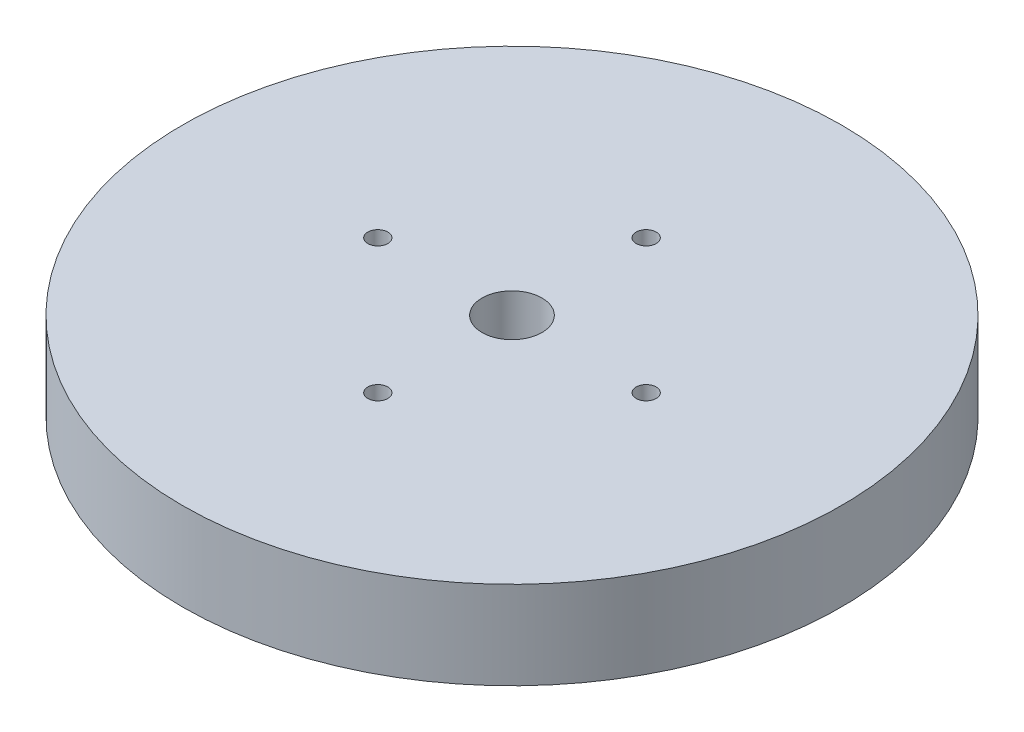
ISO-10303-21;
HEADER;
FILE_DESCRIPTION(('STEP AP214'),'2;1');
FILE_NAME('part.step','',(''),(''),'','','');
FILE_SCHEMA(('AUTOMOTIVE_DESIGN { 1 0 10303 214 1 1 1 1 }'));
ENDSEC;
DATA;
#1=APPLICATION_CONTEXT('core data for automotive mechanical design processes');
#2=APPLICATION_PROTOCOL_DEFINITION('international standard','automotive_design',2000,#1);
#3=PRODUCT_CONTEXT('',#1,'mechanical');
#4=PRODUCT('Part','Part','',(#3));
#5=PRODUCT_RELATED_PRODUCT_CATEGORY('part','',(#4));
#6=PRODUCT_DEFINITION_FORMATION('','',#4);
#7=PRODUCT_DEFINITION_CONTEXT('part definition',#1,'design');
#8=PRODUCT_DEFINITION('design','',#6,#7);
#9=PRODUCT_DEFINITION_SHAPE('','',#8);
#10=(LENGTH_UNIT() NAMED_UNIT(*) SI_UNIT(.MILLI.,.METRE.));
#11=(NAMED_UNIT(*) PLANE_ANGLE_UNIT() SI_UNIT($,.RADIAN.));
#12=(NAMED_UNIT(*) SI_UNIT($,.STERADIAN.) SOLID_ANGLE_UNIT());
#13=UNCERTAINTY_MEASURE_WITH_UNIT(LENGTH_MEASURE(1.E-05),#10,'distance_accuracy_value','');
#14=(GEOMETRIC_REPRESENTATION_CONTEXT(3) GLOBAL_UNCERTAINTY_ASSIGNED_CONTEXT((#13)) GLOBAL_UNIT_ASSIGNED_CONTEXT((#10,
#11,#12)) REPRESENTATION_CONTEXT('',''));
#15=CARTESIAN_POINT('',(0.,0.,0.));
#16=DIRECTION('',(0.,0.,1.));
#17=DIRECTION('',(1.,0.,0.));
#18=AXIS2_PLACEMENT_3D('',#15,#16,#17);
#19=CARTESIAN_POINT('',(0.,22.,0.));
#20=DIRECTION('',(0.,-1.,0.));
#21=DIRECTION('',(0.,0.,-1.));
#22=AXIS2_PLACEMENT_3D('',#19,#20,#21);
#23=CYLINDRICAL_SURFACE('',#22,82.5);
#24=CARTESIAN_POINT('',(0.,22.,0.));
#25=DIRECTION('',(0.,1.,0.));
#26=DIRECTION('',(0.,0.,1.));
#27=AXIS2_PLACEMENT_3D('',#24,#25,#26);
#28=CIRCLE('',#27,82.5);
#29=CARTESIAN_POINT('',(0.,22.,82.5));
#30=VERTEX_POINT('',#29);
#31=EDGE_CURVE('E10',#30,#30,#28,.T.);
#32=ORIENTED_EDGE('',*,*,#31,.F.);
#33=EDGE_LOOP('',(#32));
#34=FACE_BOUND('',#33,.T.);
#35=CARTESIAN_POINT('',(0.,0.,0.));
#36=DIRECTION('',(0.,1.,0.));
#37=DIRECTION('',(0.,0.,1.));
#38=AXIS2_PLACEMENT_3D('',#35,#36,#37);
#39=CIRCLE('',#38,82.5);
#40=CARTESIAN_POINT('',(0.,0.,82.5));
#41=VERTEX_POINT('',#40);
#42=EDGE_CURVE('E37',#41,#41,#39,.T.);
#43=ORIENTED_EDGE('',*,*,#42,.T.);
#44=EDGE_LOOP('',(#43));
#45=FACE_BOUND('',#44,.T.);
#46=ADVANCED_FACE('F40',(#34,#45),#23,.T.);
#47=CARTESIAN_POINT('',(0.,22.,0.));
#48=DIRECTION('',(0.,1.,0.));
#49=DIRECTION('',(0.,0.,1.));
#50=AXIS2_PLACEMENT_3D('',#47,#48,#49);
#51=PLANE('',#50);
#52=CARTESIAN_POINT('',(1.17267353394834E-13,22.,33.5867049009315));
#53=DIRECTION('',(0.,1.,0.));
#54=DIRECTION('',(1.,0.,0.));
#55=AXIS2_PLACEMENT_3D('',#52,#53,#54);
#56=CIRCLE('',#55,2.50603523285753);
#57=CARTESIAN_POINT('',(2.50603523285764,22.,33.5867049009315));
#58=VERTEX_POINT('',#57);
#59=EDGE_CURVE('E71',#58,#58,#56,.T.);
#60=ORIENTED_EDGE('',*,*,#59,.F.);
#61=EDGE_LOOP('',(#60));
#62=FACE_BOUND('',#61,.T.);
#63=CARTESIAN_POINT('',(33.5867049009315,22.,0.));
#64=DIRECTION('',(0.,1.,0.));
#65=DIRECTION('',(0.,0.,-1.));
#66=AXIS2_PLACEMENT_3D('',#63,#64,#65);
#67=CIRCLE('',#66,2.50603523285753);
#68=CARTESIAN_POINT('',(33.5867049009315,22.,-2.50603523285753));
#69=VERTEX_POINT('',#68);
#70=EDGE_CURVE('E70',#69,#69,#67,.T.);
#71=ORIENTED_EDGE('',*,*,#70,.F.);
#72=EDGE_LOOP('',(#71));
#73=FACE_BOUND('',#72,.T.);
#74=CARTESIAN_POINT('',(-3.51802060184501E-13,22.,-33.5867049009315));
#75=DIRECTION('',(0.,1.,0.));
#76=DIRECTION('',(-1.,0.,0.));
#77=AXIS2_PLACEMENT_3D('',#74,#75,#76);
#78=CIRCLE('',#77,2.50603523285753);
#79=CARTESIAN_POINT('',(-2.50603523285788,22.,-33.5867049009315));
#80=VERTEX_POINT('',#79);
#81=EDGE_CURVE('E61',#80,#80,#78,.T.);
#82=ORIENTED_EDGE('',*,*,#81,.F.);
#83=EDGE_LOOP('',(#82));
#84=FACE_BOUND('',#83,.T.);
#85=CARTESIAN_POINT('',(-33.5867049009315,22.,0.));
#86=DIRECTION('',(0.,1.,0.));
#87=DIRECTION('',(0.,0.,1.));
#88=AXIS2_PLACEMENT_3D('',#85,#86,#87);
#89=CIRCLE('',#88,2.50603523285753);
#90=CARTESIAN_POINT('',(-33.5867049009315,22.,2.50603523285753));
#91=VERTEX_POINT('',#90);
#92=EDGE_CURVE('E54',#91,#91,#89,.T.);
#93=ORIENTED_EDGE('',*,*,#92,.F.);
#94=EDGE_LOOP('',(#93));
#95=FACE_BOUND('',#94,.T.);
#96=CARTESIAN_POINT('',(0.,22.,0.));
#97=DIRECTION('',(0.,1.,0.));
#98=DIRECTION('',(0.,0.,1.));
#99=AXIS2_PLACEMENT_3D('',#96,#97,#98);
#100=CIRCLE('',#99,7.5);
#101=CARTESIAN_POINT('',(0.,22.,7.5));
#102=VERTEX_POINT('',#101);
#103=EDGE_CURVE('E50',#102,#102,#100,.T.);
#104=ORIENTED_EDGE('',*,*,#103,.F.);
#105=EDGE_LOOP('',(#104));
#106=FACE_BOUND('',#105,.T.);
#107=ORIENTED_EDGE('',*,*,#31,.T.);
#108=EDGE_LOOP('',(#107));
#109=FACE_BOUND('',#108,.T.);
#110=ADVANCED_FACE('F86',(#62,#73,#84,#95,#106,#109),#51,.T.);
#111=CARTESIAN_POINT('',(0.,0.,0.));
#112=DIRECTION('',(0.,1.,0.));
#113=DIRECTION('',(0.,0.,1.));
#114=AXIS2_PLACEMENT_3D('',#111,#112,#113);
#115=PLANE('',#114);
#116=CARTESIAN_POINT('',(0.,0.,0.));
#117=DIRECTION('',(0.,1.,0.));
#118=DIRECTION('',(0.,0.,1.));
#119=AXIS2_PLACEMENT_3D('',#116,#117,#118);
#120=CIRCLE('',#119,7.5);
#121=CARTESIAN_POINT('',(0.,0.,7.5));
#122=VERTEX_POINT('',#121);
#123=EDGE_CURVE('E47',#122,#122,#120,.T.);
#124=ORIENTED_EDGE('',*,*,#123,.T.);
#125=EDGE_LOOP('',(#124));
#126=FACE_BOUND('',#125,.T.);
#127=ORIENTED_EDGE('',*,*,#42,.F.);
#128=EDGE_LOOP('',(#127));
#129=FACE_BOUND('',#128,.T.);
#130=ADVANCED_FACE('F93',(#126,#129),#115,.F.);
#131=CARTESIAN_POINT('',(0.,22.,0.));
#132=DIRECTION('',(0.,-1.,0.));
#133=DIRECTION('',(0.,0.,-1.));
#134=AXIS2_PLACEMENT_3D('',#131,#132,#133);
#135=CYLINDRICAL_SURFACE('',#134,7.5);
#136=ORIENTED_EDGE('',*,*,#103,.T.);
#137=EDGE_LOOP('',(#136));
#138=FACE_BOUND('',#137,.T.);
#139=ORIENTED_EDGE('',*,*,#123,.F.);
#140=EDGE_LOOP('',(#139));
#141=FACE_BOUND('',#140,.T.);
#142=ADVANCED_FACE('F101',(#138,#141),#135,.F.);
#143=CARTESIAN_POINT('',(-33.5867049009315,6.68360934721259,0.));
#144=DIRECTION('',(0.,1.,0.));
#145=DIRECTION('',(0.,0.,1.));
#146=AXIS2_PLACEMENT_3D('',#143,#144,#145);
#147=CYLINDRICAL_SURFACE('',#146,2.50603523285753);
#148=CARTESIAN_POINT('',(-33.5867049009315,6.68360934721259,0.));
#149=DIRECTION('',(0.,1.,0.));
#150=DIRECTION('',(0.,0.,1.));
#151=AXIS2_PLACEMENT_3D('',#148,#149,#150);
#152=CIRCLE('',#151,2.50603523285753);
#153=CARTESIAN_POINT('',(-33.5867049009315,6.68360934721259,2.50603523285753));
#154=VERTEX_POINT('',#153);
#155=EDGE_CURVE('E55',#154,#154,#152,.T.);
#156=ORIENTED_EDGE('',*,*,#155,.F.);
#157=EDGE_LOOP('',(#156));
#158=FACE_BOUND('',#157,.T.);
#159=ORIENTED_EDGE('',*,*,#92,.T.);
#160=EDGE_LOOP('',(#159));
#161=FACE_BOUND('',#160,.T.);
#162=ADVANCED_FACE('F102',(#158,#161),#147,.F.);
#163=CARTESIAN_POINT('',(-33.5867049009315,6.68360934721259,0.));
#164=DIRECTION('',(0.,1.,0.));
#165=DIRECTION('',(0.,0.,1.));
#166=AXIS2_PLACEMENT_3D('',#163,#164,#165);
#167=PLANE('',#166);
#168=ORIENTED_EDGE('',*,*,#155,.T.);
#169=EDGE_LOOP('',(#168));
#170=FACE_BOUND('',#169,.T.);
#171=ADVANCED_FACE('F133',(#170),#167,.T.);
#172=CARTESIAN_POINT('',(-3.51802060184501E-13,6.68360934721259,-33.5867049009315));
#173=DIRECTION('',(0.,1.,0.));
#174=DIRECTION('',(0.,0.,1.));
#175=AXIS2_PLACEMENT_3D('',#172,#173,#174);
#176=CYLINDRICAL_SURFACE('',#175,2.50603523285753);
#177=CARTESIAN_POINT('',(-3.51802060184501E-13,6.68360934721259,-33.5867049009315));
#178=DIRECTION('',(0.,1.,0.));
#179=DIRECTION('',(-1.,0.,0.));
#180=AXIS2_PLACEMENT_3D('',#177,#178,#179);
#181=CIRCLE('',#180,2.50603523285753);
#182=CARTESIAN_POINT('',(-2.50603523285788,6.68360934721259,-33.5867049009315));
#183=VERTEX_POINT('',#182);
#184=EDGE_CURVE('E63',#183,#183,#181,.T.);
#185=ORIENTED_EDGE('',*,*,#184,.F.);
#186=EDGE_LOOP('',(#185));
#187=FACE_BOUND('',#186,.T.);
#188=ORIENTED_EDGE('',*,*,#81,.T.);
#189=EDGE_LOOP('',(#188));
#190=FACE_BOUND('',#189,.T.);
#191=ADVANCED_FACE('F142',(#187,#190),#176,.F.);
#192=CARTESIAN_POINT('',(-3.51802060184501E-13,6.68360934721259,-33.5867049009315));
#193=DIRECTION('',(0.,1.,0.));
#194=DIRECTION('',(-1.,0.,0.));
#195=AXIS2_PLACEMENT_3D('',#192,#193,#194);
#196=PLANE('',#195);
#197=ORIENTED_EDGE('',*,*,#184,.T.);
#198=EDGE_LOOP('',(#197));
#199=FACE_BOUND('',#198,.T.);
#200=ADVANCED_FACE('F156',(#199),#196,.T.);
#201=CARTESIAN_POINT('',(33.5867049009315,6.68360934721259,0.));
#202=DIRECTION('',(0.,1.,0.));
#203=DIRECTION('',(0.,0.,1.));
#204=AXIS2_PLACEMENT_3D('',#201,#202,#203);
#205=CYLINDRICAL_SURFACE('',#204,2.50603523285753);
#206=CARTESIAN_POINT('',(33.5867049009315,6.68360934721259,0.));
#207=DIRECTION('',(0.,1.,0.));
#208=DIRECTION('',(0.,0.,-1.));
#209=AXIS2_PLACEMENT_3D('',#206,#207,#208);
#210=CIRCLE('',#209,2.50603523285753);
#211=CARTESIAN_POINT('',(33.5867049009315,6.68360934721259,-2.50603523285753));
#212=VERTEX_POINT('',#211);
#213=EDGE_CURVE('E69',#212,#212,#210,.T.);
#214=ORIENTED_EDGE('',*,*,#213,.F.);
#215=EDGE_LOOP('',(#214));
#216=FACE_BOUND('',#215,.T.);
#217=ORIENTED_EDGE('',*,*,#70,.T.);
#218=EDGE_LOOP('',(#217));
#219=FACE_BOUND('',#218,.T.);
#220=ADVANCED_FACE('F164',(#216,#219),#205,.F.);
#221=CARTESIAN_POINT('',(33.5867049009315,6.68360934721259,0.));
#222=DIRECTION('',(0.,1.,0.));
#223=DIRECTION('',(0.,0.,-1.));
#224=AXIS2_PLACEMENT_3D('',#221,#222,#223);
#225=PLANE('',#224);
#226=ORIENTED_EDGE('',*,*,#213,.T.);
#227=EDGE_LOOP('',(#226));
#228=FACE_BOUND('',#227,.T.);
#229=ADVANCED_FACE('F83',(#228),#225,.T.);
#230=CARTESIAN_POINT('',(1.17267353394834E-13,6.68360934721259,33.5867049009315));
#231=DIRECTION('',(0.,1.,0.));
#232=DIRECTION('',(0.,0.,1.));
#233=AXIS2_PLACEMENT_3D('',#230,#231,#232);
#234=CYLINDRICAL_SURFACE('',#233,2.50603523285753);
#235=CARTESIAN_POINT('',(1.17267353394834E-13,6.68360934721259,33.5867049009315));
#236=DIRECTION('',(0.,1.,0.));
#237=DIRECTION('',(1.,0.,0.));
#238=AXIS2_PLACEMENT_3D('',#235,#236,#237);
#239=CIRCLE('',#238,2.50603523285753);
#240=CARTESIAN_POINT('',(2.50603523285764,6.68360934721259,33.5867049009315));
#241=VERTEX_POINT('',#240);
#242=EDGE_CURVE('E59',#241,#241,#239,.T.);
#243=ORIENTED_EDGE('',*,*,#242,.F.);
#244=EDGE_LOOP('',(#243));
#245=FACE_BOUND('',#244,.T.);
#246=ORIENTED_EDGE('',*,*,#59,.T.);
#247=EDGE_LOOP('',(#246));
#248=FACE_BOUND('',#247,.T.);
#249=ADVANCED_FACE('F81',(#245,#248),#234,.F.);
#250=CARTESIAN_POINT('',(1.17267353394834E-13,6.68360934721259,33.5867049009315));
#251=DIRECTION('',(0.,1.,0.));
#252=DIRECTION('',(1.,0.,0.));
#253=AXIS2_PLACEMENT_3D('',#250,#251,#252);
#254=PLANE('',#253);
#255=ORIENTED_EDGE('',*,*,#242,.T.);
#256=EDGE_LOOP('',(#255));
#257=FACE_BOUND('',#256,.T.);
#258=ADVANCED_FACE('F78',(#257),#254,.T.);
#259=CLOSED_SHELL('',(#46,#110,#130,#142,#162,#171,#191,#200,#220,#229,#249,#258));
#260=MANIFOLD_SOLID_BREP('B2',#259);
#261=ADVANCED_BREP_SHAPE_REPRESENTATION('',(#18,#260),#14);
#262=SHAPE_DEFINITION_REPRESENTATION(#9,#261);
ENDSEC;
END-ISO-10303-21;
